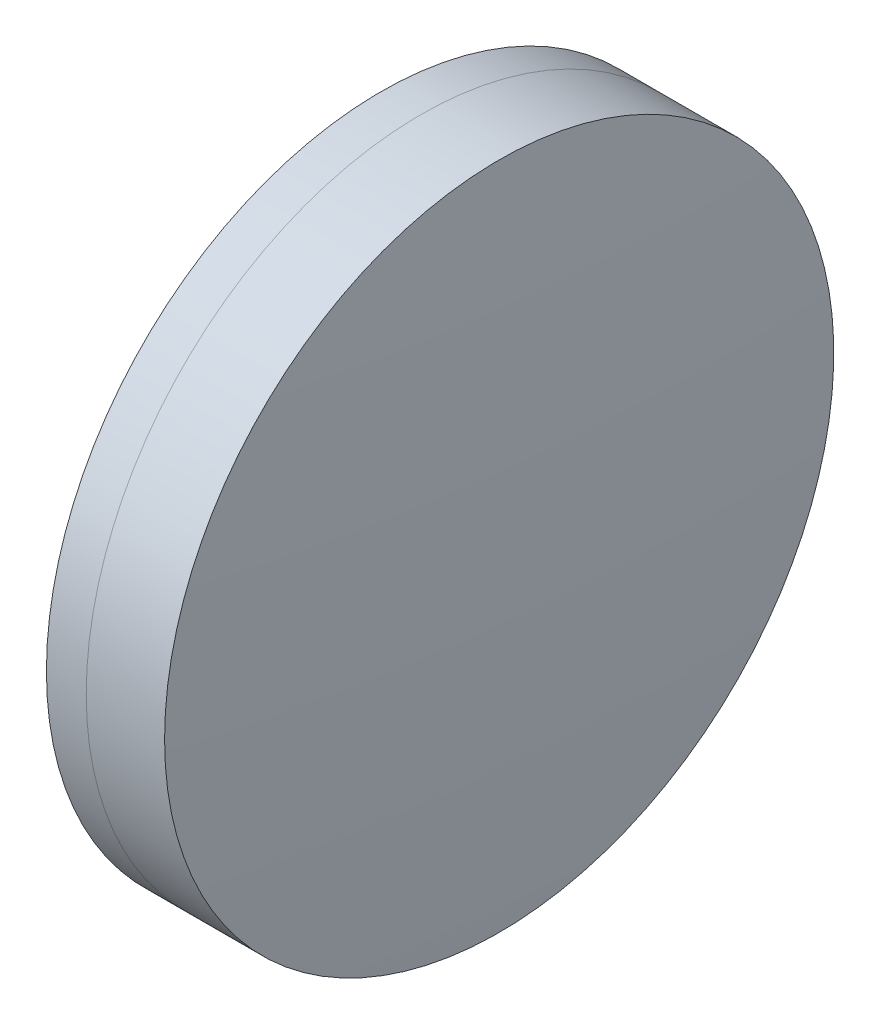
ISO-10303-21;
HEADER;
FILE_DESCRIPTION(('STEP AP214'),'2;1');
FILE_NAME('part.step','',(''),(''),'','','');
FILE_SCHEMA(('AUTOMOTIVE_DESIGN { 1 0 10303 214 1 1 1 1 }'));
ENDSEC;
DATA;
#1=APPLICATION_CONTEXT('core data for automotive mechanical design processes');
#2=APPLICATION_PROTOCOL_DEFINITION('international standard','automotive_design',2000,#1);
#3=PRODUCT_CONTEXT('',#1,'mechanical');
#4=PRODUCT('Part','Part','',(#3));
#5=PRODUCT_RELATED_PRODUCT_CATEGORY('part','',(#4));
#6=PRODUCT_DEFINITION_FORMATION('','',#4);
#7=PRODUCT_DEFINITION_CONTEXT('part definition',#1,'design');
#8=PRODUCT_DEFINITION('design','',#6,#7);
#9=PRODUCT_DEFINITION_SHAPE('','',#8);
#10=(LENGTH_UNIT() NAMED_UNIT(*) SI_UNIT(.MILLI.,.METRE.));
#11=(NAMED_UNIT(*) PLANE_ANGLE_UNIT() SI_UNIT($,.RADIAN.));
#12=(NAMED_UNIT(*) SI_UNIT($,.STERADIAN.) SOLID_ANGLE_UNIT());
#13=UNCERTAINTY_MEASURE_WITH_UNIT(LENGTH_MEASURE(1.E-05),#10,'distance_accuracy_value','');
#14=(GEOMETRIC_REPRESENTATION_CONTEXT(3) GLOBAL_UNCERTAINTY_ASSIGNED_CONTEXT((#13)) GLOBAL_UNIT_ASSIGNED_CONTEXT((#10,
#11,#12)) REPRESENTATION_CONTEXT('',''));
#15=CARTESIAN_POINT('',(0.,0.,0.));
#16=DIRECTION('',(0.,0.,1.));
#17=DIRECTION('',(1.,0.,0.));
#18=AXIS2_PLACEMENT_3D('',#15,#16,#17);
#19=CARTESIAN_POINT('',(180.903228187027,0.,0.));
#20=DIRECTION('',(-1.,0.,0.));
#21=DIRECTION('',(0.,0.,1.));
#22=AXIS2_PLACEMENT_3D('',#19,#20,#21);
#23=SPHERICAL_SURFACE('',#22,75.479);
#24=CARTESIAN_POINT('',(254.720685072238,0.,0.));
#25=DIRECTION('',(-1.,0.,0.));
#26=DIRECTION('',(0.,0.,1.));
#27=AXIS2_PLACEMENT_3D('',#24,#25,#26);
#28=CIRCLE('',#27,15.75);
#29=CARTESIAN_POINT('',(254.720685072238,0.,15.75));
#30=VERTEX_POINT('',#29);
#31=EDGE_CURVE('E11',#30,#30,#28,.T.);
#32=ORIENTED_EDGE('',*,*,#31,.T.);
#33=EDGE_LOOP('',(#32));
#34=FACE_BOUND('',#33,.T.);
#35=ADVANCED_FACE('F45',(#34),#23,.F.);
#36=CARTESIAN_POINT('',(-0.551919992657797,0.,0.));
#37=DIRECTION('',(-1.,0.,0.));
#38=DIRECTION('',(0.,0.,1.));
#39=AXIS2_PLACEMENT_3D('',#36,#37,#38);
#40=CYLINDRICAL_SURFACE('',#39,15.75);
#41=CARTESIAN_POINT('',(258.408614000489,0.,0.));
#42=DIRECTION('',(-1.,0.,0.));
#43=DIRECTION('',(0.,0.,1.));
#44=AXIS2_PLACEMENT_3D('',#41,#42,#43);
#45=CIRCLE('',#44,15.75);
#46=CARTESIAN_POINT('',(258.408614000489,0.,15.75));
#47=VERTEX_POINT('',#46);
#48=EDGE_CURVE('E51',#47,#47,#45,.T.);
#49=ORIENTED_EDGE('',*,*,#48,.T.);
#50=EDGE_LOOP('',(#49));
#51=FACE_BOUND('',#50,.T.);
#52=ORIENTED_EDGE('',*,*,#31,.F.);
#53=EDGE_LOOP('',(#52));
#54=FACE_BOUND('',#53,.T.);
#55=ADVANCED_FACE('F57',(#51,#54),#40,.T.);
#56=CARTESIAN_POINT('',(26.2392281870271,0.,0.));
#57=DIRECTION('',(-1.,0.,0.));
#58=DIRECTION('',(0.,0.,1.));
#59=AXIS2_PLACEMENT_3D('',#56,#57,#58);
#60=SPHERICAL_SURFACE('',#59,232.703);
#61=ORIENTED_EDGE('',*,*,#48,.F.);
#62=EDGE_LOOP('',(#61));
#63=FACE_BOUND('',#62,.T.);
#64=ADVANCED_FACE('F60',(#63),#60,.T.);
#65=CLOSED_SHELL('',(#35,#55,#64));
#66=MANIFOLD_SOLID_BREP('B2',#65);
#67=CARTESIAN_POINT('',(351.923228187027,0.,0.));
#68=DIRECTION('',(-1.,0.,0.));
#69=DIRECTION('',(0.,0.,1.));
#70=AXIS2_PLACEMENT_3D('',#67,#68,#69);
#71=SPHERICAL_SURFACE('',#70,100.321);
#72=CARTESIAN_POINT('',(252.846285657496,0.,0.));
#73=DIRECTION('',(-1.,0.,0.));
#74=DIRECTION('',(0.,0.,1.));
#75=AXIS2_PLACEMENT_3D('',#72,#73,#74);
#76=CIRCLE('',#75,15.75);
#77=CARTESIAN_POINT('',(252.846285657496,0.,15.75));
#78=VERTEX_POINT('',#77);
#79=EDGE_CURVE('E44',#78,#78,#76,.T.);
#80=ORIENTED_EDGE('',*,*,#79,.T.);
#81=EDGE_LOOP('',(#80));
#82=FACE_BOUND('',#81,.T.);
#83=ADVANCED_FACE('F86',(#82),#71,.T.);
#84=CARTESIAN_POINT('',(124.523309526045,0.,0.));
#85=DIRECTION('',(-1.,0.,0.));
#86=DIRECTION('',(0.,0.,1.));
#87=AXIS2_PLACEMENT_3D('',#84,#85,#86);
#88=CYLINDRICAL_SURFACE('',#87,15.75);
#89=CARTESIAN_POINT('',(254.720685072238,0.,0.));
#90=DIRECTION('',(-1.,0.,0.));
#91=DIRECTION('',(0.,0.,1.));
#92=AXIS2_PLACEMENT_3D('',#89,#90,#91);
#93=CIRCLE('',#92,15.75);
#94=CARTESIAN_POINT('',(254.720685072238,0.,15.75));
#95=VERTEX_POINT('',#94);
#96=EDGE_CURVE('E92',#95,#95,#93,.T.);
#97=ORIENTED_EDGE('',*,*,#96,.T.);
#98=EDGE_LOOP('',(#97));
#99=FACE_BOUND('',#98,.T.);
#100=ORIENTED_EDGE('',*,*,#79,.F.);
#101=EDGE_LOOP('',(#100));
#102=FACE_BOUND('',#101,.T.);
#103=ADVANCED_FACE('F98',(#99,#102),#88,.T.);
#104=CARTESIAN_POINT('',(180.903228187027,0.,0.));
#105=DIRECTION('',(-1.,0.,0.));
#106=DIRECTION('',(0.,0.,1.));
#107=AXIS2_PLACEMENT_3D('',#104,#105,#106);
#108=SPHERICAL_SURFACE('',#107,75.4790000000001);
#109=ORIENTED_EDGE('',*,*,#96,.F.);
#110=EDGE_LOOP('',(#109));
#111=FACE_BOUND('',#110,.T.);
#112=ADVANCED_FACE('F101',(#111),#108,.T.);
#113=CLOSED_SHELL('',(#83,#103,#112));
#114=MANIFOLD_SOLID_BREP('B6',#113);
#115=ADVANCED_BREP_SHAPE_REPRESENTATION('',(#18,#66,#114),#14);
#116=SHAPE_DEFINITION_REPRESENTATION(#9,#115);
ENDSEC;
END-ISO-10303-21;
